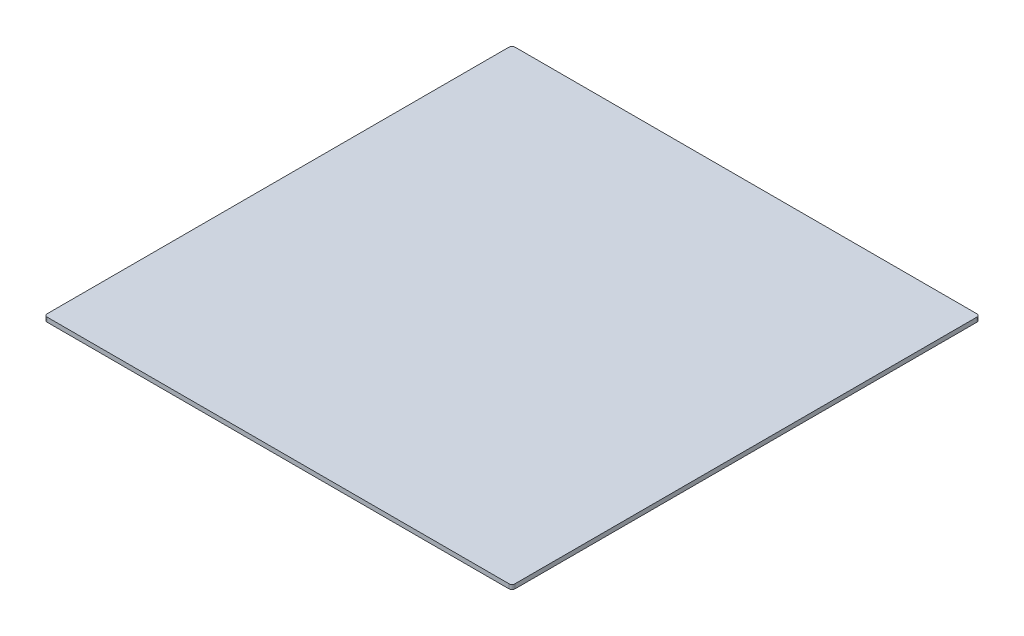
ISO-10303-21;
HEADER;
FILE_DESCRIPTION(('STEP AP214'),'2;1');
FILE_NAME('part.step','',(''),(''),'','','');
FILE_SCHEMA(('AUTOMOTIVE_DESIGN { 1 0 10303 214 1 1 1 1 }'));
ENDSEC;
DATA;
#1=APPLICATION_CONTEXT('core data for automotive mechanical design processes');
#2=APPLICATION_PROTOCOL_DEFINITION('international standard','automotive_design',2000,#1);
#3=PRODUCT_CONTEXT('',#1,'mechanical');
#4=PRODUCT('Part','Part','',(#3));
#5=PRODUCT_RELATED_PRODUCT_CATEGORY('part','',(#4));
#6=PRODUCT_DEFINITION_FORMATION('','',#4);
#7=PRODUCT_DEFINITION_CONTEXT('part definition',#1,'design');
#8=PRODUCT_DEFINITION('design','',#6,#7);
#9=PRODUCT_DEFINITION_SHAPE('','',#8);
#10=(LENGTH_UNIT() NAMED_UNIT(*) SI_UNIT(.MILLI.,.METRE.));
#11=(NAMED_UNIT(*) PLANE_ANGLE_UNIT() SI_UNIT($,.RADIAN.));
#12=(NAMED_UNIT(*) SI_UNIT($,.STERADIAN.) SOLID_ANGLE_UNIT());
#13=UNCERTAINTY_MEASURE_WITH_UNIT(LENGTH_MEASURE(1.E-05),#10,'distance_accuracy_value','');
#14=(GEOMETRIC_REPRESENTATION_CONTEXT(3) GLOBAL_UNCERTAINTY_ASSIGNED_CONTEXT((#13)) GLOBAL_UNIT_ASSIGNED_CONTEXT((#10,
#11,#12)) REPRESENTATION_CONTEXT('',''));
#15=CARTESIAN_POINT('',(0.,0.,0.));
#16=DIRECTION('',(0.,0.,1.));
#17=DIRECTION('',(1.,0.,0.));
#18=AXIS2_PLACEMENT_3D('',#15,#16,#17);
#19=CARTESIAN_POINT('',(-157.5,3.,157.5));
#20=DIRECTION('',(1.,0.,0.));
#21=DIRECTION('',(0.,0.,-1.));
#22=AXIS2_PLACEMENT_3D('',#19,#20,#21);
#23=PLANE('',#22);
#24=DIRECTION('',(0.,0.,1.));
#25=VECTOR('',#24,1.);
#26=CARTESIAN_POINT('',(-157.5,3.,157.5));
#27=LINE('',#26,#25);
#28=CARTESIAN_POINT('',(-157.5,3.,-155.5));
#29=VERTEX_POINT('',#28);
#30=CARTESIAN_POINT('',(-157.5,3.,155.5));
#31=VERTEX_POINT('',#30);
#32=EDGE_CURVE('E117',#29,#31,#27,.T.);
#33=ORIENTED_EDGE('',*,*,#32,.F.);
#34=DIRECTION('',(0.,-1.,0.));
#35=VECTOR('',#34,1.);
#36=CARTESIAN_POINT('',(-157.5,3.,-155.5));
#37=LINE('',#36,#35);
#38=CARTESIAN_POINT('',(-157.5,0.,-155.5));
#39=VERTEX_POINT('',#38);
#40=EDGE_CURVE('E102',#29,#39,#37,.T.);
#41=ORIENTED_EDGE('',*,*,#40,.T.);
#42=DIRECTION('',(0.,0.,1.));
#43=VECTOR('',#42,1.);
#44=CARTESIAN_POINT('',(-157.5,0.,157.5));
#45=LINE('',#44,#43);
#46=CARTESIAN_POINT('',(-157.5,0.,155.5));
#47=VERTEX_POINT('',#46);
#48=EDGE_CURVE('E114',#39,#47,#45,.T.);
#49=ORIENTED_EDGE('',*,*,#48,.T.);
#50=DIRECTION('',(0.,-1.,0.));
#51=VECTOR('',#50,1.);
#52=CARTESIAN_POINT('',(-157.5,3.,155.5));
#53=LINE('',#52,#51);
#54=EDGE_CURVE('E119',#47,#31,#53,.F.);
#55=ORIENTED_EDGE('',*,*,#54,.T.);
#56=EDGE_LOOP('',(#33,#41,#49,#55));
#57=FACE_BOUND('',#56,.T.);
#58=ADVANCED_FACE('F32',(#57),#23,.F.);
#59=CARTESIAN_POINT('',(157.5,3.,157.5));
#60=DIRECTION('',(0.,0.,-1.));
#61=DIRECTION('',(-1.,0.,0.));
#62=AXIS2_PLACEMENT_3D('',#59,#60,#61);
#63=PLANE('',#62);
#64=DIRECTION('',(1.,0.,0.));
#65=VECTOR('',#64,1.);
#66=CARTESIAN_POINT('',(157.5,0.,157.5));
#67=LINE('',#66,#65);
#68=CARTESIAN_POINT('',(-155.5,0.,157.5));
#69=VERTEX_POINT('',#68);
#70=CARTESIAN_POINT('',(155.5,0.,157.5));
#71=VERTEX_POINT('',#70);
#72=EDGE_CURVE('E123',#69,#71,#67,.T.);
#73=ORIENTED_EDGE('',*,*,#72,.T.);
#74=DIRECTION('',(0.,-1.,0.));
#75=VECTOR('',#74,1.);
#76=CARTESIAN_POINT('',(155.5,3.,157.5));
#77=LINE('',#76,#75);
#78=CARTESIAN_POINT('',(155.5,3.,157.5));
#79=VERTEX_POINT('',#78);
#80=EDGE_CURVE('E11',#71,#79,#77,.F.);
#81=ORIENTED_EDGE('',*,*,#80,.T.);
#82=DIRECTION('',(1.,0.,0.));
#83=VECTOR('',#82,1.);
#84=CARTESIAN_POINT('',(157.5,3.,157.5));
#85=LINE('',#84,#83);
#86=CARTESIAN_POINT('',(-155.5,3.,157.5));
#87=VERTEX_POINT('',#86);
#88=EDGE_CURVE('E159',#87,#79,#85,.T.);
#89=ORIENTED_EDGE('',*,*,#88,.F.);
#90=DIRECTION('',(0.,-1.,0.));
#91=VECTOR('',#90,1.);
#92=CARTESIAN_POINT('',(-155.5,3.,157.5));
#93=LINE('',#92,#91);
#94=EDGE_CURVE('E40',#87,#69,#93,.T.);
#95=ORIENTED_EDGE('',*,*,#94,.T.);
#96=EDGE_LOOP('',(#73,#81,#89,#95));
#97=FACE_BOUND('',#96,.T.);
#98=ADVANCED_FACE('F157',(#97),#63,.F.);
#99=CARTESIAN_POINT('',(157.5,3.,157.5));
#100=DIRECTION('',(-1.,0.,0.));
#101=DIRECTION('',(0.,0.,1.));
#102=AXIS2_PLACEMENT_3D('',#99,#100,#101);
#103=PLANE('',#102);
#104=DIRECTION('',(0.,0.,-1.));
#105=VECTOR('',#104,1.);
#106=CARTESIAN_POINT('',(157.5,0.,157.5));
#107=LINE('',#106,#105);
#108=CARTESIAN_POINT('',(157.5,0.,155.5));
#109=VERTEX_POINT('',#108);
#110=CARTESIAN_POINT('',(157.5,0.,-155.5));
#111=VERTEX_POINT('',#110);
#112=EDGE_CURVE('E126',#109,#111,#107,.T.);
#113=ORIENTED_EDGE('',*,*,#112,.T.);
#114=DIRECTION('',(0.,-1.,0.));
#115=VECTOR('',#114,1.);
#116=CARTESIAN_POINT('',(157.5,3.,-155.5));
#117=LINE('',#116,#115);
#118=CARTESIAN_POINT('',(157.5,3.,-155.5));
#119=VERTEX_POINT('',#118);
#120=EDGE_CURVE('E47',#111,#119,#117,.F.);
#121=ORIENTED_EDGE('',*,*,#120,.T.);
#122=DIRECTION('',(0.,0.,-1.));
#123=VECTOR('',#122,1.);
#124=CARTESIAN_POINT('',(157.5,3.,157.5));
#125=LINE('',#124,#123);
#126=CARTESIAN_POINT('',(157.5,3.,155.5));
#127=VERTEX_POINT('',#126);
#128=EDGE_CURVE('E167',#127,#119,#125,.T.);
#129=ORIENTED_EDGE('',*,*,#128,.F.);
#130=DIRECTION('',(0.,-1.,0.));
#131=VECTOR('',#130,1.);
#132=CARTESIAN_POINT('',(157.5,3.,155.5));
#133=LINE('',#132,#131);
#134=EDGE_CURVE('E150',#127,#109,#133,.T.);
#135=ORIENTED_EDGE('',*,*,#134,.T.);
#136=EDGE_LOOP('',(#113,#121,#129,#135));
#137=FACE_BOUND('',#136,.T.);
#138=ADVANCED_FACE('F166',(#137),#103,.F.);
#139=CARTESIAN_POINT('',(157.5,3.,-157.5));
#140=DIRECTION('',(0.,0.,1.));
#141=DIRECTION('',(1.,0.,0.));
#142=AXIS2_PLACEMENT_3D('',#139,#140,#141);
#143=PLANE('',#142);
#144=DIRECTION('',(-1.,0.,0.));
#145=VECTOR('',#144,1.);
#146=CARTESIAN_POINT('',(157.5,0.,-157.5));
#147=LINE('',#146,#145);
#148=CARTESIAN_POINT('',(155.5,0.,-157.5));
#149=VERTEX_POINT('',#148);
#150=CARTESIAN_POINT('',(-155.5,0.,-157.5));
#151=VERTEX_POINT('',#150);
#152=EDGE_CURVE('E133',#149,#151,#147,.T.);
#153=ORIENTED_EDGE('',*,*,#152,.T.);
#154=DIRECTION('',(0.,-1.,0.));
#155=VECTOR('',#154,1.);
#156=CARTESIAN_POINT('',(-155.5,3.,-157.5));
#157=LINE('',#156,#155);
#158=CARTESIAN_POINT('',(-155.5,3.,-157.5));
#159=VERTEX_POINT('',#158);
#160=EDGE_CURVE('E103',#151,#159,#157,.F.);
#161=ORIENTED_EDGE('',*,*,#160,.T.);
#162=DIRECTION('',(-1.,0.,0.));
#163=VECTOR('',#162,1.);
#164=CARTESIAN_POINT('',(157.5,3.,-157.5));
#165=LINE('',#164,#163);
#166=CARTESIAN_POINT('',(155.5,3.,-157.5));
#167=VERTEX_POINT('',#166);
#168=EDGE_CURVE('E129',#167,#159,#165,.T.);
#169=ORIENTED_EDGE('',*,*,#168,.F.);
#170=DIRECTION('',(0.,-1.,0.));
#171=VECTOR('',#170,1.);
#172=CARTESIAN_POINT('',(155.5,3.,-157.5));
#173=LINE('',#172,#171);
#174=EDGE_CURVE('E108',#167,#149,#173,.T.);
#175=ORIENTED_EDGE('',*,*,#174,.T.);
#176=EDGE_LOOP('',(#153,#161,#169,#175));
#177=FACE_BOUND('',#176,.T.);
#178=ADVANCED_FACE('F195',(#177),#143,.F.);
#179=CARTESIAN_POINT('',(0.,3.,0.));
#180=DIRECTION('',(0.,1.,0.));
#181=DIRECTION('',(0.,0.,1.));
#182=AXIS2_PLACEMENT_3D('',#179,#180,#181);
#183=PLANE('',#182);
#184=ORIENTED_EDGE('',*,*,#168,.T.);
#185=CARTESIAN_POINT('',(-155.5,3.,-155.5));
#186=DIRECTION('',(0.,1.,0.));
#187=DIRECTION('',(0.,0.,1.));
#188=AXIS2_PLACEMENT_3D('',#185,#186,#187);
#189=CIRCLE('',#188,2.);
#190=EDGE_CURVE('E148',#159,#29,#189,.T.);
#191=ORIENTED_EDGE('',*,*,#190,.T.);
#192=ORIENTED_EDGE('',*,*,#32,.T.);
#193=CARTESIAN_POINT('',(-155.5,3.,155.5));
#194=DIRECTION('',(0.,1.,0.));
#195=DIRECTION('',(0.,0.,1.));
#196=AXIS2_PLACEMENT_3D('',#193,#194,#195);
#197=CIRCLE('',#196,2.);
#198=EDGE_CURVE('E143',#31,#87,#197,.T.);
#199=ORIENTED_EDGE('',*,*,#198,.T.);
#200=ORIENTED_EDGE('',*,*,#88,.T.);
#201=CARTESIAN_POINT('',(155.5,3.,155.5));
#202=DIRECTION('',(0.,1.,0.));
#203=DIRECTION('',(0.,0.,1.));
#204=AXIS2_PLACEMENT_3D('',#201,#202,#203);
#205=CIRCLE('',#204,2.);
#206=EDGE_CURVE('E54',#79,#127,#205,.T.);
#207=ORIENTED_EDGE('',*,*,#206,.T.);
#208=ORIENTED_EDGE('',*,*,#128,.T.);
#209=CARTESIAN_POINT('',(155.5,3.,-155.5));
#210=DIRECTION('',(0.,1.,0.));
#211=DIRECTION('',(0.,0.,1.));
#212=AXIS2_PLACEMENT_3D('',#209,#210,#211);
#213=CIRCLE('',#212,2.);
#214=EDGE_CURVE('E146',#119,#167,#213,.T.);
#215=ORIENTED_EDGE('',*,*,#214,.T.);
#216=EDGE_LOOP('',(#184,#191,#192,#199,#200,#207,#208,#215));
#217=FACE_BOUND('',#216,.T.);
#218=ADVANCED_FACE('F172',(#217),#183,.T.);
#219=CARTESIAN_POINT('',(0.,0.,0.));
#220=DIRECTION('',(0.,1.,0.));
#221=DIRECTION('',(0.,0.,1.));
#222=AXIS2_PLACEMENT_3D('',#219,#220,#221);
#223=PLANE('',#222);
#224=ORIENTED_EDGE('',*,*,#48,.F.);
#225=CARTESIAN_POINT('',(-155.5,0.,-155.5));
#226=DIRECTION('',(0.,1.,0.));
#227=DIRECTION('',(0.,0.,1.));
#228=AXIS2_PLACEMENT_3D('',#225,#226,#227);
#229=CIRCLE('',#228,2.);
#230=EDGE_CURVE('E98',#39,#151,#229,.F.);
#231=ORIENTED_EDGE('',*,*,#230,.T.);
#232=ORIENTED_EDGE('',*,*,#152,.F.);
#233=CARTESIAN_POINT('',(155.5,0.,-155.5));
#234=DIRECTION('',(0.,1.,0.));
#235=DIRECTION('',(0.,0.,1.));
#236=AXIS2_PLACEMENT_3D('',#233,#234,#235);
#237=CIRCLE('',#236,2.);
#238=EDGE_CURVE('E109',#149,#111,#237,.F.);
#239=ORIENTED_EDGE('',*,*,#238,.T.);
#240=ORIENTED_EDGE('',*,*,#112,.F.);
#241=CARTESIAN_POINT('',(155.5,0.,155.5));
#242=DIRECTION('',(0.,1.,0.));
#243=DIRECTION('',(0.,0.,1.));
#244=AXIS2_PLACEMENT_3D('',#241,#242,#243);
#245=CIRCLE('',#244,2.);
#246=EDGE_CURVE('E137',#109,#71,#245,.F.);
#247=ORIENTED_EDGE('',*,*,#246,.T.);
#248=ORIENTED_EDGE('',*,*,#72,.F.);
#249=CARTESIAN_POINT('',(-155.5,0.,155.5));
#250=DIRECTION('',(0.,1.,0.));
#251=DIRECTION('',(0.,0.,1.));
#252=AXIS2_PLACEMENT_3D('',#249,#250,#251);
#253=CIRCLE('',#252,2.);
#254=EDGE_CURVE('E118',#69,#47,#253,.F.);
#255=ORIENTED_EDGE('',*,*,#254,.T.);
#256=EDGE_LOOP('',(#224,#231,#232,#239,#240,#247,#248,#255));
#257=FACE_BOUND('',#256,.T.);
#258=ADVANCED_FACE('F121',(#257),#223,.F.);
#259=CARTESIAN_POINT('',(-155.5,3.,-155.5));
#260=DIRECTION('',(0.,-1.,0.));
#261=DIRECTION('',(0.,0.,-1.));
#262=AXIS2_PLACEMENT_3D('',#259,#260,#261);
#263=CYLINDRICAL_SURFACE('',#262,2.);
#264=ORIENTED_EDGE('',*,*,#190,.F.);
#265=ORIENTED_EDGE('',*,*,#160,.F.);
#266=ORIENTED_EDGE('',*,*,#230,.F.);
#267=ORIENTED_EDGE('',*,*,#40,.F.);
#268=EDGE_LOOP('',(#264,#265,#266,#267));
#269=FACE_BOUND('',#268,.T.);
#270=ADVANCED_FACE('F101',(#269),#263,.T.);
#271=CARTESIAN_POINT('',(155.5,3.,-155.5));
#272=DIRECTION('',(0.,-1.,0.));
#273=DIRECTION('',(0.,0.,-1.));
#274=AXIS2_PLACEMENT_3D('',#271,#272,#273);
#275=CYLINDRICAL_SURFACE('',#274,2.);
#276=ORIENTED_EDGE('',*,*,#214,.F.);
#277=ORIENTED_EDGE('',*,*,#120,.F.);
#278=ORIENTED_EDGE('',*,*,#238,.F.);
#279=ORIENTED_EDGE('',*,*,#174,.F.);
#280=EDGE_LOOP('',(#276,#277,#278,#279));
#281=FACE_BOUND('',#280,.T.);
#282=ADVANCED_FACE('F177',(#281),#275,.T.);
#283=CARTESIAN_POINT('',(155.5,3.,155.5));
#284=DIRECTION('',(0.,-1.,0.));
#285=DIRECTION('',(0.,0.,-1.));
#286=AXIS2_PLACEMENT_3D('',#283,#284,#285);
#287=CYLINDRICAL_SURFACE('',#286,2.);
#288=ORIENTED_EDGE('',*,*,#206,.F.);
#289=ORIENTED_EDGE('',*,*,#80,.F.);
#290=ORIENTED_EDGE('',*,*,#246,.F.);
#291=ORIENTED_EDGE('',*,*,#134,.F.);
#292=EDGE_LOOP('',(#288,#289,#290,#291));
#293=FACE_BOUND('',#292,.T.);
#294=ADVANCED_FACE('F165',(#293),#287,.T.);
#295=CARTESIAN_POINT('',(-155.5,3.,155.5));
#296=DIRECTION('',(0.,-1.,0.));
#297=DIRECTION('',(0.,0.,-1.));
#298=AXIS2_PLACEMENT_3D('',#295,#296,#297);
#299=CYLINDRICAL_SURFACE('',#298,2.);
#300=ORIENTED_EDGE('',*,*,#198,.F.);
#301=ORIENTED_EDGE('',*,*,#54,.F.);
#302=ORIENTED_EDGE('',*,*,#254,.F.);
#303=ORIENTED_EDGE('',*,*,#94,.F.);
#304=EDGE_LOOP('',(#300,#301,#302,#303));
#305=FACE_BOUND('',#304,.T.);
#306=ADVANCED_FACE('F34',(#305),#299,.T.);
#307=CLOSED_SHELL('',(#58,#98,#138,#178,#218,#258,#270,#282,#294,#306));
#308=MANIFOLD_SOLID_BREP('B2',#307);
#309=ADVANCED_BREP_SHAPE_REPRESENTATION('',(#18,#308),#14);
#310=SHAPE_DEFINITION_REPRESENTATION(#9,#309);
ENDSEC;
END-ISO-10303-21;
